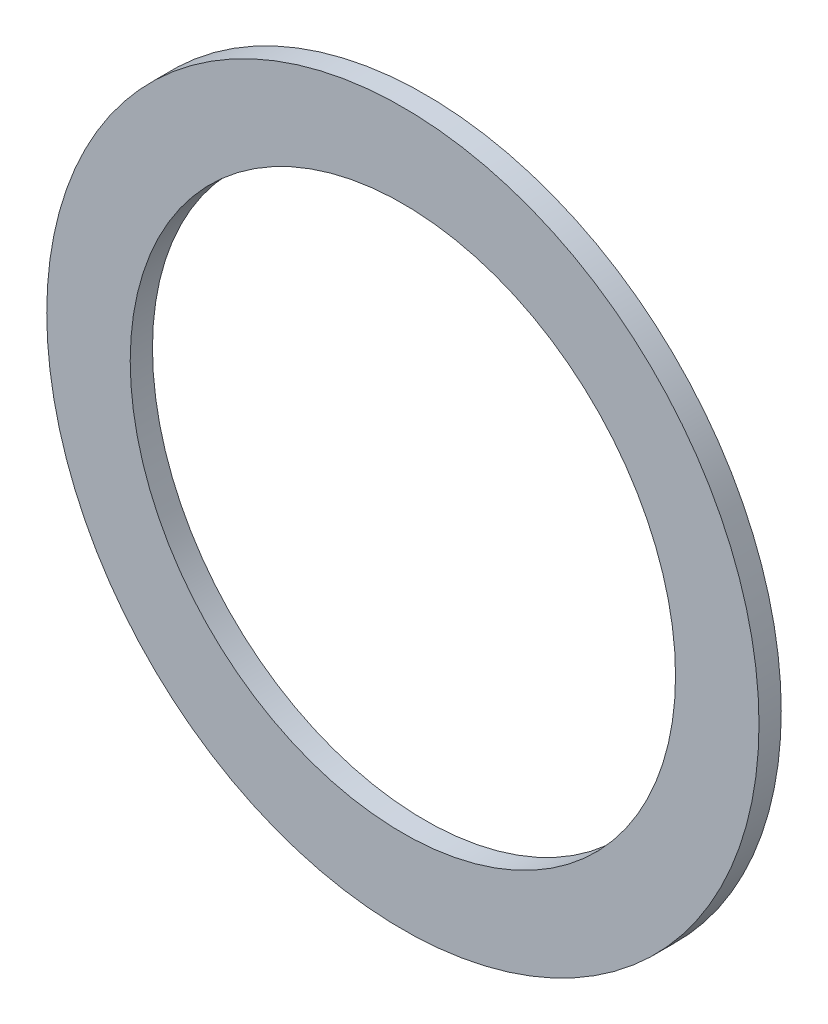
ISO-10303-21;
HEADER;
FILE_DESCRIPTION(('STEP AP214'),'2;1');
FILE_NAME('part.step','',(''),(''),'','','');
FILE_SCHEMA(('AUTOMOTIVE_DESIGN { 1 0 10303 214 1 1 1 1 }'));
ENDSEC;
DATA;
#1=APPLICATION_CONTEXT('core data for automotive mechanical design processes');
#2=APPLICATION_PROTOCOL_DEFINITION('international standard','automotive_design',2000,#1);
#3=PRODUCT_CONTEXT('',#1,'mechanical');
#4=PRODUCT('Part','Part','',(#3));
#5=PRODUCT_RELATED_PRODUCT_CATEGORY('part','',(#4));
#6=PRODUCT_DEFINITION_FORMATION('','',#4);
#7=PRODUCT_DEFINITION_CONTEXT('part definition',#1,'design');
#8=PRODUCT_DEFINITION('design','',#6,#7);
#9=PRODUCT_DEFINITION_SHAPE('','',#8);
#10=(LENGTH_UNIT() NAMED_UNIT(*) SI_UNIT(.MILLI.,.METRE.));
#11=(NAMED_UNIT(*) PLANE_ANGLE_UNIT() SI_UNIT($,.RADIAN.));
#12=(NAMED_UNIT(*) SI_UNIT($,.STERADIAN.) SOLID_ANGLE_UNIT());
#13=UNCERTAINTY_MEASURE_WITH_UNIT(LENGTH_MEASURE(1.E-05),#10,'distance_accuracy_value','');
#14=(GEOMETRIC_REPRESENTATION_CONTEXT(3) GLOBAL_UNCERTAINTY_ASSIGNED_CONTEXT((#13)) GLOBAL_UNIT_ASSIGNED_CONTEXT((#10,
#11,#12)) REPRESENTATION_CONTEXT('',''));
#15=CARTESIAN_POINT('',(0.,0.,0.));
#16=DIRECTION('',(0.,0.,1.));
#17=DIRECTION('',(1.,0.,0.));
#18=AXIS2_PLACEMENT_3D('',#15,#16,#17);
#19=CARTESIAN_POINT('',(0.,0.,1.));
#20=DIRECTION('',(0.,0.,1.));
#21=DIRECTION('',(1.,0.,0.));
#22=AXIS2_PLACEMENT_3D('',#19,#20,#21);
#23=PLANE('',#22);
#24=CARTESIAN_POINT('',(0.,0.,1.));
#25=DIRECTION('',(0.,0.,1.));
#26=DIRECTION('',(1.,0.,0.));
#27=AXIS2_PLACEMENT_3D('',#24,#25,#26);
#28=CIRCLE('',#27,16.);
#29=CARTESIAN_POINT('',(16.,0.,1.));
#30=VERTEX_POINT('',#29);
#31=EDGE_CURVE('E10',#30,#30,#28,.T.);
#32=ORIENTED_EDGE('',*,*,#31,.T.);
#33=EDGE_LOOP('',(#32));
#34=FACE_BOUND('',#33,.T.);
#35=CARTESIAN_POINT('',(0.,0.,1.));
#36=DIRECTION('',(0.,0.,1.));
#37=DIRECTION('',(1.,0.,0.));
#38=AXIS2_PLACEMENT_3D('',#35,#36,#37);
#39=CIRCLE('',#38,12.25);
#40=CARTESIAN_POINT('',(12.25,0.,1.));
#41=VERTEX_POINT('',#40);
#42=EDGE_CURVE('E42',#41,#41,#39,.T.);
#43=ORIENTED_EDGE('',*,*,#42,.F.);
#44=EDGE_LOOP('',(#43));
#45=FACE_BOUND('',#44,.T.);
#46=ADVANCED_FACE('F31',(#34,#45),#23,.T.);
#47=CARTESIAN_POINT('',(0.,0.,0.));
#48=DIRECTION('',(0.,0.,1.));
#49=DIRECTION('',(1.,0.,0.));
#50=AXIS2_PLACEMENT_3D('',#47,#48,#49);
#51=PLANE('',#50);
#52=CARTESIAN_POINT('',(0.,0.,0.));
#53=DIRECTION('',(0.,0.,1.));
#54=DIRECTION('',(1.,0.,0.));
#55=AXIS2_PLACEMENT_3D('',#52,#53,#54);
#56=CIRCLE('',#55,16.);
#57=CARTESIAN_POINT('',(16.,0.,0.));
#58=VERTEX_POINT('',#57);
#59=EDGE_CURVE('E35',#58,#58,#56,.T.);
#60=ORIENTED_EDGE('',*,*,#59,.F.);
#61=EDGE_LOOP('',(#60));
#62=FACE_BOUND('',#61,.T.);
#63=CARTESIAN_POINT('',(0.,0.,0.));
#64=DIRECTION('',(0.,0.,1.));
#65=DIRECTION('',(1.,0.,0.));
#66=AXIS2_PLACEMENT_3D('',#63,#64,#65);
#67=CIRCLE('',#66,12.25);
#68=CARTESIAN_POINT('',(12.25,0.,0.));
#69=VERTEX_POINT('',#68);
#70=EDGE_CURVE('E44',#69,#69,#67,.T.);
#71=ORIENTED_EDGE('',*,*,#70,.T.);
#72=EDGE_LOOP('',(#71));
#73=FACE_BOUND('',#72,.T.);
#74=ADVANCED_FACE('F54',(#62,#73),#51,.F.);
#75=CARTESIAN_POINT('',(0.,0.,1.));
#76=DIRECTION('',(0.,0.,-1.));
#77=DIRECTION('',(-1.,0.,0.));
#78=AXIS2_PLACEMENT_3D('',#75,#76,#77);
#79=CYLINDRICAL_SURFACE('',#78,16.);
#80=ORIENTED_EDGE('',*,*,#31,.F.);
#81=EDGE_LOOP('',(#80));
#82=FACE_BOUND('',#81,.T.);
#83=ORIENTED_EDGE('',*,*,#59,.T.);
#84=EDGE_LOOP('',(#83));
#85=FACE_BOUND('',#84,.T.);
#86=ADVANCED_FACE('F33',(#82,#85),#79,.T.);
#87=CARTESIAN_POINT('',(0.,0.,1.));
#88=DIRECTION('',(0.,0.,-1.));
#89=DIRECTION('',(-1.,0.,0.));
#90=AXIS2_PLACEMENT_3D('',#87,#88,#89);
#91=CYLINDRICAL_SURFACE('',#90,12.25);
#92=ORIENTED_EDGE('',*,*,#42,.T.);
#93=EDGE_LOOP('',(#92));
#94=FACE_BOUND('',#93,.T.);
#95=ORIENTED_EDGE('',*,*,#70,.F.);
#96=EDGE_LOOP('',(#95));
#97=FACE_BOUND('',#96,.T.);
#98=ADVANCED_FACE('F50',(#94,#97),#91,.F.);
#99=CLOSED_SHELL('',(#46,#74,#86,#98));
#100=MANIFOLD_SOLID_BREP('B2',#99);
#101=ADVANCED_BREP_SHAPE_REPRESENTATION('',(#18,#100),#14);
#102=SHAPE_DEFINITION_REPRESENTATION(#9,#101);
ENDSEC;
END-ISO-10303-21;
